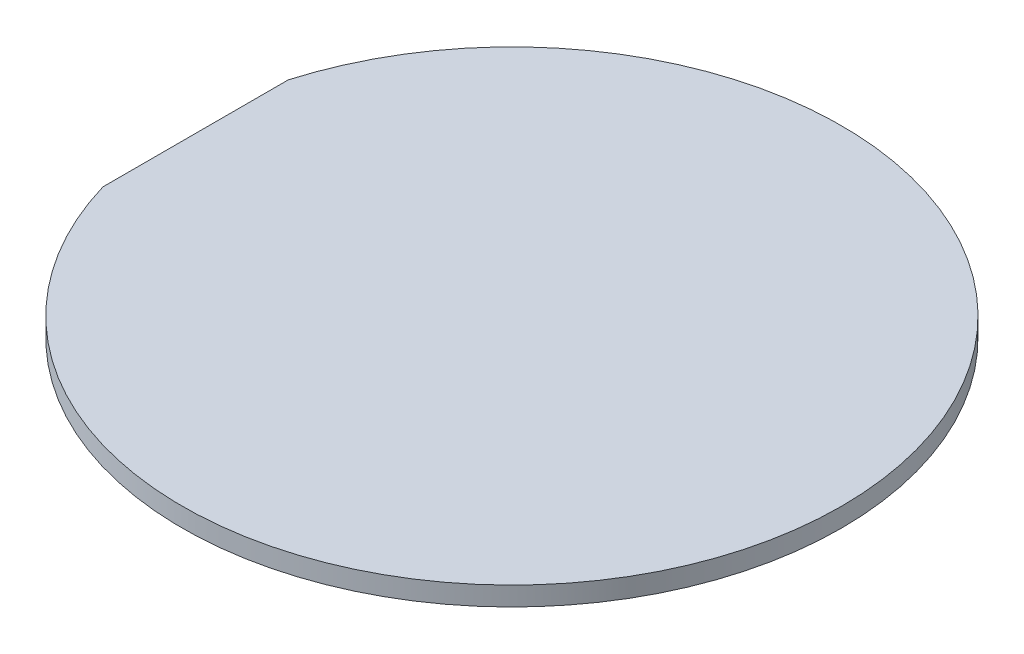
ISO-10303-21;
HEADER;
FILE_DESCRIPTION(('STEP AP214'),'2;1');
FILE_NAME('part.step','',(''),(''),'','','');
FILE_SCHEMA(('AUTOMOTIVE_DESIGN { 1 0 10303 214 1 1 1 1 }'));
ENDSEC;
DATA;
#1=APPLICATION_CONTEXT('core data for automotive mechanical design processes');
#2=APPLICATION_PROTOCOL_DEFINITION('international standard','automotive_design',2000,#1);
#3=PRODUCT_CONTEXT('',#1,'mechanical');
#4=PRODUCT('Part','Part','',(#3));
#5=PRODUCT_RELATED_PRODUCT_CATEGORY('part','',(#4));
#6=PRODUCT_DEFINITION_FORMATION('','',#4);
#7=PRODUCT_DEFINITION_CONTEXT('part definition',#1,'design');
#8=PRODUCT_DEFINITION('design','',#6,#7);
#9=PRODUCT_DEFINITION_SHAPE('','',#8);
#10=(LENGTH_UNIT() NAMED_UNIT(*) SI_UNIT(.MILLI.,.METRE.));
#11=(NAMED_UNIT(*) PLANE_ANGLE_UNIT() SI_UNIT($,.RADIAN.));
#12=(NAMED_UNIT(*) SI_UNIT($,.STERADIAN.) SOLID_ANGLE_UNIT());
#13=UNCERTAINTY_MEASURE_WITH_UNIT(LENGTH_MEASURE(1.E-05),#10,'distance_accuracy_value','');
#14=(GEOMETRIC_REPRESENTATION_CONTEXT(3) GLOBAL_UNCERTAINTY_ASSIGNED_CONTEXT((#13)) GLOBAL_UNIT_ASSIGNED_CONTEXT((#10,
#11,#12)) REPRESENTATION_CONTEXT('',''));
#15=CARTESIAN_POINT('',(0.,0.,0.));
#16=DIRECTION('',(0.,0.,1.));
#17=DIRECTION('',(1.,0.,0.));
#18=AXIS2_PLACEMENT_3D('',#15,#16,#17);
#19=CARTESIAN_POINT('',(0.,1.,0.));
#20=DIRECTION('',(0.,-1.,0.));
#21=DIRECTION('',(0.,0.,-1.));
#22=AXIS2_PLACEMENT_3D('',#19,#20,#21);
#23=CYLINDRICAL_SURFACE('',#22,15.9);
#24=CARTESIAN_POINT('',(0.,1.,0.));
#25=DIRECTION('',(0.,1.,0.));
#26=DIRECTION('',(0.,0.,1.));
#27=AXIS2_PLACEMENT_3D('',#24,#25,#26);
#28=CIRCLE('',#27,15.9);
#29=CARTESIAN_POINT('',(0.,1.,15.9));
#30=VERTEX_POINT('',#29);
#31=EDGE_CURVE('E11',#30,#30,#28,.T.);
#32=ORIENTED_EDGE('',*,*,#31,.F.);
#33=EDGE_LOOP('',(#32));
#34=FACE_BOUND('',#33,.T.);
#35=CARTESIAN_POINT('',(0.,0.,0.));
#36=DIRECTION('',(0.,1.,0.));
#37=DIRECTION('',(0.,0.,1.));
#38=AXIS2_PLACEMENT_3D('',#35,#36,#37);
#39=CIRCLE('',#38,15.9);
#40=CARTESIAN_POINT('',(0.,0.,15.9));
#41=VERTEX_POINT('',#40);
#42=EDGE_CURVE('E40',#41,#41,#39,.T.);
#43=ORIENTED_EDGE('',*,*,#42,.T.);
#44=EDGE_LOOP('',(#43));
#45=FACE_BOUND('',#44,.T.);
#46=ADVANCED_FACE('F37',(#34,#45),#23,.T.);
#47=CARTESIAN_POINT('',(0.,0.,0.));
#48=DIRECTION('',(0.,1.,0.));
#49=DIRECTION('',(0.,0.,1.));
#50=AXIS2_PLACEMENT_3D('',#47,#48,#49);
#51=PLANE('',#50);
#52=ORIENTED_EDGE('',*,*,#42,.F.);
#53=EDGE_LOOP('',(#52));
#54=FACE_BOUND('',#53,.T.);
#55=ADVANCED_FACE('F90',(#54),#51,.F.);
#56=CARTESIAN_POINT('',(0.,2.,0.));
#57=DIRECTION('',(0.,-1.,0.));
#58=DIRECTION('',(0.,0.,-1.));
#59=AXIS2_PLACEMENT_3D('',#56,#57,#58);
#60=CYLINDRICAL_SURFACE('',#59,17.35);
#61=CARTESIAN_POINT('',(0.,2.,0.));
#62=DIRECTION('',(0.,1.,0.));
#63=DIRECTION('',(0.,0.,1.));
#64=AXIS2_PLACEMENT_3D('',#61,#62,#63);
#65=CIRCLE('',#64,17.35);
#66=CARTESIAN_POINT('',(-16.65,2.,4.8785243670602));
#67=VERTEX_POINT('',#66);
#68=CARTESIAN_POINT('',(-16.65,2.,-4.8785243670602));
#69=VERTEX_POINT('',#68);
#70=EDGE_CURVE('E73',#67,#69,#65,.T.);
#71=ORIENTED_EDGE('',*,*,#70,.F.);
#72=DIRECTION('',(0.,-1.,0.));
#73=VECTOR('',#72,1.);
#74=CARTESIAN_POINT('',(-16.65,2.,4.8785243670602));
#75=LINE('',#74,#73);
#76=CARTESIAN_POINT('',(-16.65,1.,4.8785243670602));
#77=VERTEX_POINT('',#76);
#78=EDGE_CURVE('E57',#67,#77,#75,.T.);
#79=ORIENTED_EDGE('',*,*,#78,.T.);
#80=CARTESIAN_POINT('',(0.,1.,0.));
#81=DIRECTION('',(0.,1.,0.));
#82=DIRECTION('',(0.,0.,1.));
#83=AXIS2_PLACEMENT_3D('',#80,#81,#82);
#84=CIRCLE('',#83,17.35);
#85=CARTESIAN_POINT('',(-16.65,1.,-4.8785243670602));
#86=VERTEX_POINT('',#85);
#87=EDGE_CURVE('E71',#77,#86,#84,.T.);
#88=ORIENTED_EDGE('',*,*,#87,.T.);
#89=DIRECTION('',(0.,-1.,0.));
#90=VECTOR('',#89,1.);
#91=CARTESIAN_POINT('',(-16.65,2.,-4.8785243670602));
#92=LINE('',#91,#90);
#93=EDGE_CURVE('E51',#69,#86,#92,.T.);
#94=ORIENTED_EDGE('',*,*,#93,.F.);
#95=EDGE_LOOP('',(#71,#79,#88,#94));
#96=FACE_BOUND('',#95,.T.);
#97=ADVANCED_FACE('F70',(#96),#60,.T.);
#98=CARTESIAN_POINT('',(0.,2.,0.));
#99=DIRECTION('',(0.,1.,0.));
#100=DIRECTION('',(0.,0.,1.));
#101=AXIS2_PLACEMENT_3D('',#98,#99,#100);
#102=PLANE('',#101);
#103=DIRECTION('',(0.,0.,1.));
#104=VECTOR('',#103,1.);
#105=CARTESIAN_POINT('',(-16.65,2.,4.8785243670602));
#106=LINE('',#105,#104);
#107=EDGE_CURVE('E66',#69,#67,#106,.T.);
#108=ORIENTED_EDGE('',*,*,#107,.T.);
#109=ORIENTED_EDGE('',*,*,#70,.T.);
#110=EDGE_LOOP('',(#108,#109));
#111=FACE_BOUND('',#110,.T.);
#112=ADVANCED_FACE('F81',(#111),#102,.T.);
#113=CARTESIAN_POINT('',(0.,1.,0.));
#114=DIRECTION('',(0.,1.,0.));
#115=DIRECTION('',(0.,0.,1.));
#116=AXIS2_PLACEMENT_3D('',#113,#114,#115);
#117=PLANE('',#116);
#118=ORIENTED_EDGE('',*,*,#31,.T.);
#119=EDGE_LOOP('',(#118));
#120=FACE_BOUND('',#119,.T.);
#121=ORIENTED_EDGE('',*,*,#87,.F.);
#122=DIRECTION('',(0.,0.,1.));
#123=VECTOR('',#122,1.);
#124=CARTESIAN_POINT('',(-16.65,1.,4.8785243670602));
#125=LINE('',#124,#123);
#126=EDGE_CURVE('E61',#86,#77,#125,.T.);
#127=ORIENTED_EDGE('',*,*,#126,.F.);
#128=EDGE_LOOP('',(#121,#127));
#129=FACE_BOUND('',#128,.T.);
#130=ADVANCED_FACE('F75',(#120,#129),#117,.F.);
#131=CARTESIAN_POINT('',(-16.65,2.,4.8785243670602));
#132=DIRECTION('',(1.,0.,0.));
#133=DIRECTION('',(0.,0.,-1.));
#134=AXIS2_PLACEMENT_3D('',#131,#132,#133);
#135=PLANE('',#134);
#136=ORIENTED_EDGE('',*,*,#126,.T.);
#137=ORIENTED_EDGE('',*,*,#78,.F.);
#138=ORIENTED_EDGE('',*,*,#107,.F.);
#139=ORIENTED_EDGE('',*,*,#93,.T.);
#140=EDGE_LOOP('',(#136,#137,#138,#139));
#141=FACE_BOUND('',#140,.T.);
#142=ADVANCED_FACE('F62',(#141),#135,.F.);
#143=CLOSED_SHELL('',(#46,#55,#97,#112,#130,#142));
#144=MANIFOLD_SOLID_BREP('B2',#143);
#145=ADVANCED_BREP_SHAPE_REPRESENTATION('',(#18,#144),#14);
#146=SHAPE_DEFINITION_REPRESENTATION(#9,#145);
ENDSEC;
END-ISO-10303-21;
